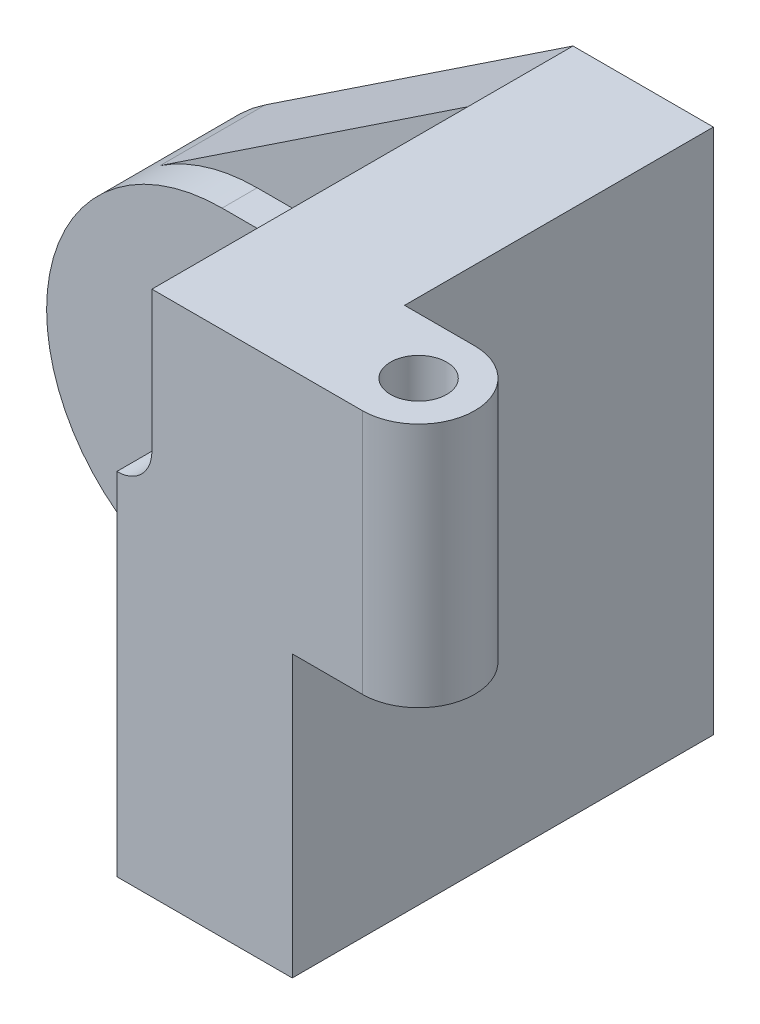
ISO-10303-21;
HEADER;
FILE_DESCRIPTION(('STEP AP214'),'2;1');
FILE_NAME('part.step','',(''),(''),'','','');
FILE_SCHEMA(('AUTOMOTIVE_DESIGN { 1 0 10303 214 1 1 1 1 }'));
ENDSEC;
DATA;
#1=APPLICATION_CONTEXT('core data for automotive mechanical design processes');
#2=APPLICATION_PROTOCOL_DEFINITION('international standard','automotive_design',2000,#1);
#3=PRODUCT_CONTEXT('',#1,'mechanical');
#4=PRODUCT('Part','Part','',(#3));
#5=PRODUCT_RELATED_PRODUCT_CATEGORY('part','',(#4));
#6=PRODUCT_DEFINITION_FORMATION('','',#4);
#7=PRODUCT_DEFINITION_CONTEXT('part definition',#1,'design');
#8=PRODUCT_DEFINITION('design','',#6,#7);
#9=PRODUCT_DEFINITION_SHAPE('','',#8);
#10=(LENGTH_UNIT() NAMED_UNIT(*) SI_UNIT(.MILLI.,.METRE.));
#11=(NAMED_UNIT(*) PLANE_ANGLE_UNIT() SI_UNIT($,.RADIAN.));
#12=(NAMED_UNIT(*) SI_UNIT($,.STERADIAN.) SOLID_ANGLE_UNIT());
#13=UNCERTAINTY_MEASURE_WITH_UNIT(LENGTH_MEASURE(1.E-05),#10,'distance_accuracy_value','');
#14=(GEOMETRIC_REPRESENTATION_CONTEXT(3) GLOBAL_UNCERTAINTY_ASSIGNED_CONTEXT((#13)) GLOBAL_UNIT_ASSIGNED_CONTEXT((#10,
#11,#12)) REPRESENTATION_CONTEXT('',''));
#15=CARTESIAN_POINT('',(0.,0.,0.));
#16=DIRECTION('',(0.,0.,1.));
#17=DIRECTION('',(1.,0.,0.));
#18=AXIS2_PLACEMENT_3D('',#15,#16,#17);
#19=CARTESIAN_POINT('',(0.,0.,20.));
#20=DIRECTION('',(0.,0.,1.));
#21=DIRECTION('',(1.,0.,0.));
#22=AXIS2_PLACEMENT_3D('',#19,#20,#21);
#23=PLANE('',#22);
#24=CARTESIAN_POINT('',(0.,0.,20.));
#25=DIRECTION('',(0.,0.,1.));
#26=DIRECTION('',(1.,0.,0.));
#27=AXIS2_PLACEMENT_3D('',#24,#25,#26);
#28=CIRCLE('',#27,10.);
#29=CARTESIAN_POINT('',(10.,0.,20.));
#30=VERTEX_POINT('',#29);
#31=EDGE_CURVE('E219',#30,#30,#28,.T.);
#32=ORIENTED_EDGE('',*,*,#31,.F.);
#33=EDGE_LOOP('',(#32));
#34=FACE_BOUND('',#33,.T.);
#35=DIRECTION('',(-1.,0.,0.));
#36=VECTOR('',#35,1.);
#37=CARTESIAN_POINT('',(0.,-25.,20.));
#38=LINE('',#37,#36);
#39=CARTESIAN_POINT('',(25.,-25.,20.));
#40=VERTEX_POINT('',#39);
#41=CARTESIAN_POINT('',(0.,-25.,20.));
#42=VERTEX_POINT('',#41);
#43=EDGE_CURVE('E213',#40,#42,#38,.T.);
#44=ORIENTED_EDGE('',*,*,#43,.F.);
#45=DIRECTION('',(0.,1.,0.));
#46=VECTOR('',#45,1.);
#47=CARTESIAN_POINT('',(25.,0.,20.));
#48=LINE('',#47,#46);
#49=CARTESIAN_POINT('',(25.,25.,20.));
#50=VERTEX_POINT('',#49);
#51=EDGE_CURVE('E185',#40,#50,#48,.T.);
#52=ORIENTED_EDGE('',*,*,#51,.T.);
#53=DIRECTION('',(1.,0.,0.));
#54=VECTOR('',#53,1.);
#55=CARTESIAN_POINT('',(0.,25.,20.));
#56=LINE('',#55,#54);
#57=CARTESIAN_POINT('',(0.,25.,20.));
#58=VERTEX_POINT('',#57);
#59=EDGE_CURVE('E216',#58,#50,#56,.T.);
#60=ORIENTED_EDGE('',*,*,#59,.F.);
#61=CARTESIAN_POINT('',(0.,0.,20.));
#62=DIRECTION('',(0.,0.,1.));
#63=DIRECTION('',(1.,0.,0.));
#64=AXIS2_PLACEMENT_3D('',#61,#62,#63);
#65=CIRCLE('',#64,25.);
#66=EDGE_CURVE('E210',#42,#58,#65,.F.);
#67=ORIENTED_EDGE('',*,*,#66,.F.);
#68=EDGE_LOOP('',(#44,#52,#60,#67));
#69=FACE_BOUND('',#68,.T.);
#70=ADVANCED_FACE('F35',(#34,#69),#23,.T.);
#71=CARTESIAN_POINT('',(0.,0.,20.));
#72=DIRECTION('',(0.,0.,-1.));
#73=DIRECTION('',(-1.,0.,0.));
#74=AXIS2_PLACEMENT_3D('',#71,#72,#73);
#75=CYLINDRICAL_SURFACE('',#74,25.);
#76=DIRECTION('',(0.,0.,-1.));
#77=VECTOR('',#76,1.);
#78=CARTESIAN_POINT('',(-13.852304692744,20.8113828156464,15.));
#79=LINE('',#78,#77);
#80=CARTESIAN_POINT('',(-13.852304692744,20.8113828156464,15.));
#81=VERTEX_POINT('',#80);
#82=CARTESIAN_POINT('',(-13.852304692744,20.8113828156464,0.));
#83=VERTEX_POINT('',#82);
#84=EDGE_CURVE('E179',#81,#83,#79,.T.);
#85=ORIENTED_EDGE('',*,*,#84,.T.);
#86=CARTESIAN_POINT('',(0.,0.,0.));
#87=DIRECTION('',(0.,0.,1.));
#88=DIRECTION('',(1.,0.,0.));
#89=AXIS2_PLACEMENT_3D('',#86,#87,#88);
#90=CIRCLE('',#89,25.);
#91=CARTESIAN_POINT('',(0.,-25.,0.));
#92=VERTEX_POINT('',#91);
#93=EDGE_CURVE('E208',#92,#83,#90,.F.);
#94=ORIENTED_EDGE('',*,*,#93,.F.);
#95=DIRECTION('',(0.,0.,-1.));
#96=VECTOR('',#95,1.);
#97=CARTESIAN_POINT('',(0.,-25.,20.));
#98=LINE('',#97,#96);
#99=EDGE_CURVE('E11',#42,#92,#98,.T.);
#100=ORIENTED_EDGE('',*,*,#99,.F.);
#101=ORIENTED_EDGE('',*,*,#66,.T.);
#102=DIRECTION('',(0.,0.,-1.));
#103=VECTOR('',#102,1.);
#104=CARTESIAN_POINT('',(0.,25.,20.));
#105=LINE('',#104,#103);
#106=CARTESIAN_POINT('',(0.,25.,15.));
#107=VERTEX_POINT('',#106);
#108=EDGE_CURVE('E222',#58,#107,#105,.T.);
#109=ORIENTED_EDGE('',*,*,#108,.T.);
#110=CARTESIAN_POINT('',(0.,0.,15.));
#111=DIRECTION('',(0.,0.,1.));
#112=DIRECTION('',(1.,0.,0.));
#113=AXIS2_PLACEMENT_3D('',#110,#111,#112);
#114=CIRCLE('',#113,25.);
#115=EDGE_CURVE('E177',#81,#107,#114,.F.);
#116=ORIENTED_EDGE('',*,*,#115,.F.);
#117=EDGE_LOOP('',(#85,#94,#100,#101,#109,#116));
#118=FACE_BOUND('',#117,.T.);
#119=ADVANCED_FACE('F37',(#118),#75,.T.);
#120=CARTESIAN_POINT('',(0.,-25.,20.));
#121=DIRECTION('',(0.,-1.,0.));
#122=DIRECTION('',(1.,0.,0.));
#123=AXIS2_PLACEMENT_3D('',#120,#121,#122);
#124=PLANE('',#123);
#125=DIRECTION('',(-1.,0.,0.));
#126=VECTOR('',#125,1.);
#127=CARTESIAN_POINT('',(0.,-25.,0.));
#128=LINE('',#127,#126);
#129=CARTESIAN_POINT('',(50.,-25.,0.));
#130=VERTEX_POINT('',#129);
#131=EDGE_CURVE('E225',#130,#92,#128,.T.);
#132=ORIENTED_EDGE('',*,*,#131,.F.);
#133=DIRECTION('',(0.,0.,-1.));
#134=VECTOR('',#133,1.);
#135=CARTESIAN_POINT('',(50.,-25.,20.));
#136=LINE('',#135,#134);
#137=CARTESIAN_POINT('',(50.,-25.,60.));
#138=VERTEX_POINT('',#137);
#139=EDGE_CURVE('E43',#138,#130,#136,.T.);
#140=ORIENTED_EDGE('',*,*,#139,.F.);
#141=DIRECTION('',(1.,0.,0.));
#142=VECTOR('',#141,1.);
#143=CARTESIAN_POINT('',(0.,-25.,60.));
#144=LINE('',#143,#142);
#145=CARTESIAN_POINT('',(25.,-25.,60.));
#146=VERTEX_POINT('',#145);
#147=EDGE_CURVE('E197',#146,#138,#144,.T.);
#148=ORIENTED_EDGE('',*,*,#147,.F.);
#149=DIRECTION('',(0.,0.,-1.));
#150=VECTOR('',#149,1.);
#151=CARTESIAN_POINT('',(25.,-25.,60.));
#152=LINE('',#151,#150);
#153=EDGE_CURVE('E203',#146,#40,#152,.T.);
#154=ORIENTED_EDGE('',*,*,#153,.T.);
#155=ORIENTED_EDGE('',*,*,#43,.T.);
#156=ORIENTED_EDGE('',*,*,#99,.T.);
#157=EDGE_LOOP('',(#132,#140,#148,#154,#155,#156));
#158=FACE_BOUND('',#157,.T.);
#159=ADVANCED_FACE('F251',(#158),#124,.T.);
#160=CARTESIAN_POINT('',(50.,0.,20.));
#161=DIRECTION('',(1.,0.,0.));
#162=DIRECTION('',(0.,0.,-1.));
#163=AXIS2_PLACEMENT_3D('',#160,#161,#162);
#164=PLANE('',#163);
#165=DIRECTION('',(0.,1.,0.));
#166=VECTOR('',#165,1.);
#167=CARTESIAN_POINT('',(50.,15.,44.));
#168=LINE('',#167,#166);
#169=CARTESIAN_POINT('',(50.,15.,44.));
#170=VERTEX_POINT('',#169);
#171=CARTESIAN_POINT('',(50.,50.,44.));
#172=VERTEX_POINT('',#171);
#173=EDGE_CURVE('E145',#170,#172,#168,.T.);
#174=ORIENTED_EDGE('',*,*,#173,.F.);
#175=DIRECTION('',(0.,0.,-1.));
#176=VECTOR('',#175,1.);
#177=CARTESIAN_POINT('',(50.,15.,0.));
#178=LINE('',#177,#176);
#179=CARTESIAN_POINT('',(50.,15.,60.));
#180=VERTEX_POINT('',#179);
#181=EDGE_CURVE('E50',#180,#170,#178,.T.);
#182=ORIENTED_EDGE('',*,*,#181,.F.);
#183=DIRECTION('',(0.,1.,0.));
#184=VECTOR('',#183,1.);
#185=CARTESIAN_POINT('',(50.,0.,60.));
#186=LINE('',#185,#184);
#187=EDGE_CURVE('E195',#138,#180,#186,.T.);
#188=ORIENTED_EDGE('',*,*,#187,.F.);
#189=ORIENTED_EDGE('',*,*,#139,.T.);
#190=DIRECTION('',(0.,-1.,0.));
#191=VECTOR('',#190,1.);
#192=CARTESIAN_POINT('',(50.,0.,0.));
#193=LINE('',#192,#191);
#194=CARTESIAN_POINT('',(50.,50.,0.));
#195=VERTEX_POINT('',#194);
#196=EDGE_CURVE('E228',#195,#130,#193,.T.);
#197=ORIENTED_EDGE('',*,*,#196,.F.);
#198=DIRECTION('',(0.,0.,-1.));
#199=VECTOR('',#198,1.);
#200=CARTESIAN_POINT('',(50.,50.,20.));
#201=LINE('',#200,#199);
#202=EDGE_CURVE('E56',#172,#195,#201,.T.);
#203=ORIENTED_EDGE('',*,*,#202,.F.);
#204=EDGE_LOOP('',(#174,#182,#188,#189,#197,#203));
#205=FACE_BOUND('',#204,.T.);
#206=ADVANCED_FACE('F248',(#205),#164,.T.);
#207=CARTESIAN_POINT('',(0.,50.,20.));
#208=DIRECTION('',(0.,1.,0.));
#209=DIRECTION('',(0.,0.,1.));
#210=AXIS2_PLACEMENT_3D('',#207,#208,#209);
#211=PLANE('',#210);
#212=DIRECTION('',(1.,0.,0.));
#213=VECTOR('',#212,1.);
#214=CARTESIAN_POINT('',(0.,50.,0.));
#215=LINE('',#214,#213);
#216=CARTESIAN_POINT('',(30.,50.,0.));
#217=VERTEX_POINT('',#216);
#218=EDGE_CURVE('E231',#217,#195,#215,.T.);
#219=ORIENTED_EDGE('',*,*,#218,.F.);
#220=DIRECTION('',(0.,0.,-1.));
#221=VECTOR('',#220,1.);
#222=CARTESIAN_POINT('',(30.,50.,15.));
#223=LINE('',#222,#221);
#224=CARTESIAN_POINT('',(30.,50.,15.));
#225=VERTEX_POINT('',#224);
#226=EDGE_CURVE('E183',#225,#217,#223,.T.);
#227=ORIENTED_EDGE('',*,*,#226,.F.);
#228=DIRECTION('',(0.,0.,-1.));
#229=VECTOR('',#228,1.);
#230=CARTESIAN_POINT('',(30.,50.,20.));
#231=LINE('',#230,#229);
#232=CARTESIAN_POINT('',(30.,50.,60.));
#233=VERTEX_POINT('',#232);
#234=EDGE_CURVE('E244',#233,#225,#231,.T.);
#235=ORIENTED_EDGE('',*,*,#234,.F.);
#236=DIRECTION('',(-1.,0.,0.));
#237=VECTOR('',#236,1.);
#238=CARTESIAN_POINT('',(0.,50.,60.));
#239=LINE('',#238,#237);
#240=CARTESIAN_POINT('',(60.,50.,60.));
#241=VERTEX_POINT('',#240);
#242=EDGE_CURVE('E192',#241,#233,#239,.T.);
#243=ORIENTED_EDGE('',*,*,#242,.F.);
#244=CARTESIAN_POINT('',(60.,50.,52.));
#245=DIRECTION('',(0.,1.,0.));
#246=DIRECTION('',(0.,0.,1.));
#247=AXIS2_PLACEMENT_3D('',#244,#245,#246);
#248=CIRCLE('',#247,8.);
#249=CARTESIAN_POINT('',(60.,50.,44.));
#250=VERTEX_POINT('',#249);
#251=EDGE_CURVE('E162',#250,#241,#248,.F.);
#252=ORIENTED_EDGE('',*,*,#251,.F.);
#253=DIRECTION('',(1.,0.,0.));
#254=VECTOR('',#253,1.);
#255=CARTESIAN_POINT('',(0.,50.,44.));
#256=LINE('',#255,#254);
#257=EDGE_CURVE('E141',#172,#250,#256,.T.);
#258=ORIENTED_EDGE('',*,*,#257,.F.);
#259=ORIENTED_EDGE('',*,*,#202,.T.);
#260=EDGE_LOOP('',(#219,#227,#235,#243,#252,#258,#259));
#261=FACE_BOUND('',#260,.T.);
#262=CARTESIAN_POINT('',(60.,50.,52.));
#263=DIRECTION('',(0.,1.,0.));
#264=DIRECTION('',(0.,0.,1.));
#265=AXIS2_PLACEMENT_3D('',#262,#263,#264);
#266=CIRCLE('',#265,4.00000000000001);
#267=CARTESIAN_POINT('',(60.,50.,56.));
#268=VERTEX_POINT('',#267);
#269=EDGE_CURVE('E159',#268,#268,#266,.T.);
#270=ORIENTED_EDGE('',*,*,#269,.F.);
#271=EDGE_LOOP('',(#270));
#272=FACE_BOUND('',#271,.T.);
#273=ADVANCED_FACE('F261',(#261,#272),#211,.T.);
#274=CARTESIAN_POINT('',(30.,0.,20.));
#275=DIRECTION('',(1.,0.,0.));
#276=DIRECTION('',(0.,1.,0.));
#277=AXIS2_PLACEMENT_3D('',#274,#275,#276);
#278=PLANE('',#277);
#279=ORIENTED_EDGE('',*,*,#234,.T.);
#280=DIRECTION('',(0.,-1.,0.));
#281=VECTOR('',#280,1.);
#282=CARTESIAN_POINT('',(30.,0.,15.));
#283=LINE('',#282,#281);
#284=CARTESIAN_POINT('',(30.,30.,15.));
#285=VERTEX_POINT('',#284);
#286=EDGE_CURVE('E172',#225,#285,#283,.T.);
#287=ORIENTED_EDGE('',*,*,#286,.T.);
#288=DIRECTION('',(0.,0.,-1.));
#289=VECTOR('',#288,1.);
#290=CARTESIAN_POINT('',(30.,30.,20.));
#291=LINE('',#290,#289);
#292=CARTESIAN_POINT('',(30.,30.,60.));
#293=VERTEX_POINT('',#292);
#294=EDGE_CURVE('E241',#293,#285,#291,.T.);
#295=ORIENTED_EDGE('',*,*,#294,.F.);
#296=DIRECTION('',(0.,1.,0.));
#297=VECTOR('',#296,1.);
#298=CARTESIAN_POINT('',(30.,0.,60.));
#299=LINE('',#298,#297);
#300=EDGE_CURVE('E189',#293,#233,#299,.T.);
#301=ORIENTED_EDGE('',*,*,#300,.T.);
#302=EDGE_LOOP('',(#279,#287,#295,#301));
#303=FACE_BOUND('',#302,.T.);
#304=ADVANCED_FACE('F286',(#303),#278,.F.);
#305=CARTESIAN_POINT('',(25.,30.,20.));
#306=DIRECTION('',(0.,0.,-1.));
#307=DIRECTION('',(-1.,0.,0.));
#308=AXIS2_PLACEMENT_3D('',#305,#306,#307);
#309=CYLINDRICAL_SURFACE('',#308,5.);
#310=CARTESIAN_POINT('',(25.,30.,15.));
#311=DIRECTION('',(0.,0.,1.));
#312=DIRECTION('',(1.,0.,0.));
#313=AXIS2_PLACEMENT_3D('',#310,#311,#312);
#314=CIRCLE('',#313,5.);
#315=CARTESIAN_POINT('',(25.,25.,15.));
#316=VERTEX_POINT('',#315);
#317=EDGE_CURVE('E170',#316,#285,#314,.T.);
#318=ORIENTED_EDGE('',*,*,#317,.F.);
#319=DIRECTION('',(0.,0.,-1.));
#320=VECTOR('',#319,1.);
#321=CARTESIAN_POINT('',(25.,25.,20.));
#322=LINE('',#321,#320);
#323=EDGE_CURVE('E238',#50,#316,#322,.T.);
#324=ORIENTED_EDGE('',*,*,#323,.F.);
#325=DIRECTION('',(0.,0.,-1.));
#326=VECTOR('',#325,1.);
#327=CARTESIAN_POINT('',(25.,25.,60.));
#328=LINE('',#327,#326);
#329=CARTESIAN_POINT('',(25.,25.,60.));
#330=VERTEX_POINT('',#329);
#331=EDGE_CURVE('E206',#330,#50,#328,.T.);
#332=ORIENTED_EDGE('',*,*,#331,.F.);
#333=CARTESIAN_POINT('',(25.,30.,60.));
#334=DIRECTION('',(0.,0.,1.));
#335=DIRECTION('',(1.,0.,0.));
#336=AXIS2_PLACEMENT_3D('',#333,#334,#335);
#337=CIRCLE('',#336,5.);
#338=EDGE_CURVE('E186',#330,#293,#337,.T.);
#339=ORIENTED_EDGE('',*,*,#338,.T.);
#340=ORIENTED_EDGE('',*,*,#294,.T.);
#341=EDGE_LOOP('',(#318,#324,#332,#339,#340));
#342=FACE_BOUND('',#341,.T.);
#343=ADVANCED_FACE('F288',(#342),#309,.F.);
#344=CARTESIAN_POINT('',(0.,25.,20.));
#345=DIRECTION('',(0.,1.,0.));
#346=DIRECTION('',(0.,0.,1.));
#347=AXIS2_PLACEMENT_3D('',#344,#345,#346);
#348=PLANE('',#347);
#349=DIRECTION('',(1.,0.,0.));
#350=VECTOR('',#349,1.);
#351=CARTESIAN_POINT('',(0.,25.,15.));
#352=LINE('',#351,#350);
#353=EDGE_CURVE('E168',#107,#316,#352,.T.);
#354=ORIENTED_EDGE('',*,*,#353,.F.);
#355=ORIENTED_EDGE('',*,*,#108,.F.);
#356=ORIENTED_EDGE('',*,*,#59,.T.);
#357=ORIENTED_EDGE('',*,*,#323,.T.);
#358=EDGE_LOOP('',(#354,#355,#356,#357));
#359=FACE_BOUND('',#358,.T.);
#360=ADVANCED_FACE('F291',(#359),#348,.T.);
#361=CARTESIAN_POINT('',(0.,0.,20.));
#362=DIRECTION('',(0.,0.,-1.));
#363=DIRECTION('',(-1.,0.,0.));
#364=AXIS2_PLACEMENT_3D('',#361,#362,#363);
#365=CYLINDRICAL_SURFACE('',#364,10.);
#366=ORIENTED_EDGE('',*,*,#31,.T.);
#367=EDGE_LOOP('',(#366));
#368=FACE_BOUND('',#367,.T.);
#369=CARTESIAN_POINT('',(0.,0.,0.));
#370=DIRECTION('',(0.,0.,1.));
#371=DIRECTION('',(1.,0.,0.));
#372=AXIS2_PLACEMENT_3D('',#369,#370,#371);
#373=CIRCLE('',#372,10.);
#374=CARTESIAN_POINT('',(10.,0.,0.));
#375=VERTEX_POINT('',#374);
#376=EDGE_CURVE('E214',#375,#375,#373,.T.);
#377=ORIENTED_EDGE('',*,*,#376,.F.);
#378=EDGE_LOOP('',(#377));
#379=FACE_BOUND('',#378,.T.);
#380=ADVANCED_FACE('F293',(#368,#379),#365,.F.);
#381=CARTESIAN_POINT('',(0.,0.,0.));
#382=DIRECTION('',(0.,0.,1.));
#383=DIRECTION('',(1.,0.,0.));
#384=AXIS2_PLACEMENT_3D('',#381,#382,#383);
#385=PLANE('',#384);
#386=ORIENTED_EDGE('',*,*,#93,.T.);
#387=DIRECTION('',(-0.832455312625856,-0.55409218770976,0.));
#388=VECTOR('',#387,1.);
#389=CARTESIAN_POINT('',(-13.852304692744,20.8113828156464,0.));
#390=LINE('',#389,#388);
#391=EDGE_CURVE('E166',#217,#83,#390,.T.);
#392=ORIENTED_EDGE('',*,*,#391,.F.);
#393=ORIENTED_EDGE('',*,*,#218,.T.);
#394=ORIENTED_EDGE('',*,*,#196,.T.);
#395=ORIENTED_EDGE('',*,*,#131,.T.);
#396=EDGE_LOOP('',(#386,#392,#393,#394,#395));
#397=FACE_BOUND('',#396,.T.);
#398=ORIENTED_EDGE('',*,*,#376,.T.);
#399=EDGE_LOOP('',(#398));
#400=FACE_BOUND('',#399,.T.);
#401=ADVANCED_FACE('F255',(#397,#400),#385,.F.);
#402=CARTESIAN_POINT('',(25.,0.,60.));
#403=DIRECTION('',(-1.,0.,0.));
#404=DIRECTION('',(0.,0.,1.));
#405=AXIS2_PLACEMENT_3D('',#402,#403,#404);
#406=PLANE('',#405);
#407=ORIENTED_EDGE('',*,*,#51,.F.);
#408=ORIENTED_EDGE('',*,*,#153,.F.);
#409=DIRECTION('',(0.,1.,0.));
#410=VECTOR('',#409,1.);
#411=CARTESIAN_POINT('',(25.,0.,60.));
#412=LINE('',#411,#410);
#413=EDGE_CURVE('E200',#146,#330,#412,.T.);
#414=ORIENTED_EDGE('',*,*,#413,.T.);
#415=ORIENTED_EDGE('',*,*,#331,.T.);
#416=EDGE_LOOP('',(#407,#408,#414,#415));
#417=FACE_BOUND('',#416,.T.);
#418=ADVANCED_FACE('F271',(#417),#406,.T.);
#419=CARTESIAN_POINT('',(25.,30.,60.));
#420=DIRECTION('',(0.,0.,1.));
#421=DIRECTION('',(1.,0.,0.));
#422=AXIS2_PLACEMENT_3D('',#419,#420,#421);
#423=PLANE('',#422);
#424=ORIENTED_EDGE('',*,*,#338,.F.);
#425=ORIENTED_EDGE('',*,*,#413,.F.);
#426=ORIENTED_EDGE('',*,*,#147,.T.);
#427=ORIENTED_EDGE('',*,*,#187,.T.);
#428=DIRECTION('',(1.,0.,0.));
#429=VECTOR('',#428,1.);
#430=CARTESIAN_POINT('',(0.,15.,60.));
#431=LINE('',#430,#429);
#432=CARTESIAN_POINT('',(60.,15.,60.));
#433=VERTEX_POINT('',#432);
#434=EDGE_CURVE('E146',#180,#433,#431,.T.);
#435=ORIENTED_EDGE('',*,*,#434,.T.);
#436=DIRECTION('',(0.,1.,0.));
#437=VECTOR('',#436,1.);
#438=CARTESIAN_POINT('',(60.,15.,60.));
#439=LINE('',#438,#437);
#440=EDGE_CURVE('E150',#433,#241,#439,.T.);
#441=ORIENTED_EDGE('',*,*,#440,.T.);
#442=ORIENTED_EDGE('',*,*,#242,.T.);
#443=ORIENTED_EDGE('',*,*,#300,.F.);
#444=EDGE_LOOP('',(#424,#425,#426,#427,#435,#441,#442,#443));
#445=FACE_BOUND('',#444,.T.);
#446=ADVANCED_FACE('F266',(#445),#423,.T.);
#447=CARTESIAN_POINT('',(-13.852304692744,20.8113828156464,15.));
#448=DIRECTION('',(0.55409218770976,-0.832455312625856,0.));
#449=DIRECTION('',(0.832455312625856,0.55409218770976,0.));
#450=AXIS2_PLACEMENT_3D('',#447,#448,#449);
#451=PLANE('',#450);
#452=ORIENTED_EDGE('',*,*,#391,.T.);
#453=ORIENTED_EDGE('',*,*,#84,.F.);
#454=DIRECTION('',(-0.832455312625856,-0.55409218770976,0.));
#455=VECTOR('',#454,1.);
#456=CARTESIAN_POINT('',(-13.852304692744,20.8113828156464,15.));
#457=LINE('',#456,#455);
#458=EDGE_CURVE('E175',#225,#81,#457,.T.);
#459=ORIENTED_EDGE('',*,*,#458,.F.);
#460=ORIENTED_EDGE('',*,*,#226,.T.);
#461=EDGE_LOOP('',(#452,#453,#459,#460));
#462=FACE_BOUND('',#461,.T.);
#463=ADVANCED_FACE('F280',(#462),#451,.F.);
#464=CARTESIAN_POINT('',(0.,0.,15.));
#465=DIRECTION('',(0.,0.,1.));
#466=DIRECTION('',(1.,0.,0.));
#467=AXIS2_PLACEMENT_3D('',#464,#465,#466);
#468=PLANE('',#467);
#469=ORIENTED_EDGE('',*,*,#353,.T.);
#470=ORIENTED_EDGE('',*,*,#317,.T.);
#471=ORIENTED_EDGE('',*,*,#286,.F.);
#472=ORIENTED_EDGE('',*,*,#458,.T.);
#473=ORIENTED_EDGE('',*,*,#115,.T.);
#474=EDGE_LOOP('',(#469,#470,#471,#472,#473));
#475=FACE_BOUND('',#474,.T.);
#476=ADVANCED_FACE('F283',(#475),#468,.T.);
#477=CARTESIAN_POINT('',(60.,15.,52.));
#478=DIRECTION('',(0.,1.,0.));
#479=DIRECTION('',(0.,0.,1.));
#480=AXIS2_PLACEMENT_3D('',#477,#478,#479);
#481=CYLINDRICAL_SURFACE('',#480,8.);
#482=ORIENTED_EDGE('',*,*,#251,.T.);
#483=ORIENTED_EDGE('',*,*,#440,.F.);
#484=CARTESIAN_POINT('',(60.,15.,52.));
#485=DIRECTION('',(0.,1.,0.));
#486=DIRECTION('',(0.,0.,1.));
#487=AXIS2_PLACEMENT_3D('',#484,#485,#486);
#488=CIRCLE('',#487,8.);
#489=CARTESIAN_POINT('',(60.,15.,44.));
#490=VERTEX_POINT('',#489);
#491=EDGE_CURVE('E133',#490,#433,#488,.F.);
#492=ORIENTED_EDGE('',*,*,#491,.F.);
#493=DIRECTION('',(0.,1.,0.));
#494=VECTOR('',#493,1.);
#495=CARTESIAN_POINT('',(60.,15.,44.));
#496=LINE('',#495,#494);
#497=EDGE_CURVE('E138',#490,#250,#496,.T.);
#498=ORIENTED_EDGE('',*,*,#497,.T.);
#499=EDGE_LOOP('',(#482,#483,#492,#498));
#500=FACE_BOUND('',#499,.T.);
#501=ADVANCED_FACE('F148',(#500),#481,.T.);
#502=CARTESIAN_POINT('',(60.,15.,52.));
#503=DIRECTION('',(0.,1.,0.));
#504=DIRECTION('',(0.,0.,1.));
#505=AXIS2_PLACEMENT_3D('',#502,#503,#504);
#506=CYLINDRICAL_SURFACE('',#505,4.00000000000001);
#507=CARTESIAN_POINT('',(60.,15.,52.));
#508=DIRECTION('',(0.,1.,0.));
#509=DIRECTION('',(0.,0.,1.));
#510=AXIS2_PLACEMENT_3D('',#507,#508,#509);
#511=CIRCLE('',#510,4.00000000000001);
#512=CARTESIAN_POINT('',(60.,15.,56.));
#513=VERTEX_POINT('',#512);
#514=EDGE_CURVE('E152',#513,#513,#511,.T.);
#515=ORIENTED_EDGE('',*,*,#514,.F.);
#516=EDGE_LOOP('',(#515));
#517=FACE_BOUND('',#516,.T.);
#518=ORIENTED_EDGE('',*,*,#269,.T.);
#519=EDGE_LOOP('',(#518));
#520=FACE_BOUND('',#519,.T.);
#521=ADVANCED_FACE('F326',(#517,#520),#506,.F.);
#522=CARTESIAN_POINT('',(0.,15.,44.));
#523=DIRECTION('',(0.,0.,1.));
#524=DIRECTION('',(1.,0.,0.));
#525=AXIS2_PLACEMENT_3D('',#522,#523,#524);
#526=PLANE('',#525);
#527=ORIENTED_EDGE('',*,*,#257,.T.);
#528=ORIENTED_EDGE('',*,*,#497,.F.);
#529=DIRECTION('',(1.,0.,0.));
#530=VECTOR('',#529,1.);
#531=CARTESIAN_POINT('',(0.,15.,44.));
#532=LINE('',#531,#530);
#533=EDGE_CURVE('E128',#170,#490,#532,.T.);
#534=ORIENTED_EDGE('',*,*,#533,.F.);
#535=ORIENTED_EDGE('',*,*,#173,.T.);
#536=EDGE_LOOP('',(#527,#528,#534,#535));
#537=FACE_BOUND('',#536,.T.);
#538=ADVANCED_FACE('F139',(#537),#526,.F.);
#539=CARTESIAN_POINT('',(0.,15.,0.));
#540=DIRECTION('',(0.,1.,0.));
#541=DIRECTION('',(0.,0.,1.));
#542=AXIS2_PLACEMENT_3D('',#539,#540,#541);
#543=PLANE('',#542);
#544=ORIENTED_EDGE('',*,*,#514,.T.);
#545=EDGE_LOOP('',(#544));
#546=FACE_BOUND('',#545,.T.);
#547=ORIENTED_EDGE('',*,*,#491,.T.);
#548=ORIENTED_EDGE('',*,*,#434,.F.);
#549=ORIENTED_EDGE('',*,*,#181,.T.);
#550=ORIENTED_EDGE('',*,*,#533,.T.);
#551=EDGE_LOOP('',(#547,#548,#549,#550));
#552=FACE_BOUND('',#551,.T.);
#553=ADVANCED_FACE('F130',(#546,#552),#543,.F.);
#554=CLOSED_SHELL('',(#70,#119,#159,#206,#273,#304,#343,#360,#380,#401,#418,#446,#463,#476,#501,
#521,#538,#553));
#555=MANIFOLD_SOLID_BREP('B2',#554);
#556=ADVANCED_BREP_SHAPE_REPRESENTATION('',(#18,#555),#14);
#557=SHAPE_DEFINITION_REPRESENTATION(#9,#556);
ENDSEC;
END-ISO-10303-21;
